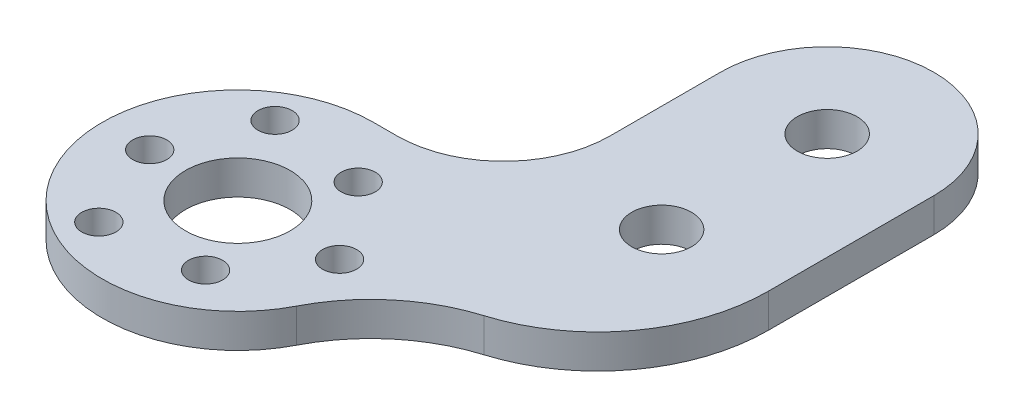
ISO-10303-21;
HEADER;
FILE_DESCRIPTION(('STEP AP214'),'2;1');
FILE_NAME('part.step','',(''),(''),'','','');
FILE_SCHEMA(('AUTOMOTIVE_DESIGN { 1 0 10303 214 1 1 1 1 }'));
ENDSEC;
DATA;
#1=APPLICATION_CONTEXT('core data for automotive mechanical design processes');
#2=APPLICATION_PROTOCOL_DEFINITION('international standard','automotive_design',2000,#1);
#3=PRODUCT_CONTEXT('',#1,'mechanical');
#4=PRODUCT('Part','Part','',(#3));
#5=PRODUCT_RELATED_PRODUCT_CATEGORY('part','',(#4));
#6=PRODUCT_DEFINITION_FORMATION('','',#4);
#7=PRODUCT_DEFINITION_CONTEXT('part definition',#1,'design');
#8=PRODUCT_DEFINITION('design','',#6,#7);
#9=PRODUCT_DEFINITION_SHAPE('','',#8);
#10=(LENGTH_UNIT() NAMED_UNIT(*) SI_UNIT(.MILLI.,.METRE.));
#11=(NAMED_UNIT(*) PLANE_ANGLE_UNIT() SI_UNIT($,.RADIAN.));
#12=(NAMED_UNIT(*) SI_UNIT($,.STERADIAN.) SOLID_ANGLE_UNIT());
#13=UNCERTAINTY_MEASURE_WITH_UNIT(LENGTH_MEASURE(1.E-05),#10,'distance_accuracy_value','');
#14=(GEOMETRIC_REPRESENTATION_CONTEXT(3) GLOBAL_UNCERTAINTY_ASSIGNED_CONTEXT((#13)) GLOBAL_UNIT_ASSIGNED_CONTEXT((#10,
#11,#12)) REPRESENTATION_CONTEXT('',''));
#15=CARTESIAN_POINT('',(0.,0.,0.));
#16=DIRECTION('',(0.,0.,1.));
#17=DIRECTION('',(1.,0.,0.));
#18=AXIS2_PLACEMENT_3D('',#15,#16,#17);
#19=CARTESIAN_POINT('',(22.18,3.175,-33.));
#20=DIRECTION('',(0.,1.,0.));
#21=DIRECTION('',(0.,0.,1.));
#22=AXIS2_PLACEMENT_3D('',#19,#20,#21);
#23=PLANE('',#22);
#24=CARTESIAN_POINT('',(-4.76313972081442,3.175,-8.25));
#25=DIRECTION('',(0.,1.,0.));
#26=DIRECTION('',(0.,0.,1.));
#27=AXIS2_PLACEMENT_3D('',#24,#25,#26);
#28=CIRCLE('',#27,1.6);
#29=CARTESIAN_POINT('',(-4.76313972081442,3.175,-6.65));
#30=VERTEX_POINT('',#29);
#31=EDGE_CURVE('E237',#30,#30,#28,.T.);
#32=ORIENTED_EDGE('',*,*,#31,.F.);
#33=EDGE_LOOP('',(#32));
#34=FACE_BOUND('',#33,.T.);
#35=CARTESIAN_POINT('',(-4.76313972081442,3.175,8.25));
#36=DIRECTION('',(0.,1.,0.));
#37=DIRECTION('',(0.,0.,1.));
#38=AXIS2_PLACEMENT_3D('',#35,#36,#37);
#39=CIRCLE('',#38,1.6);
#40=CARTESIAN_POINT('',(-4.76313972081442,3.175,9.85));
#41=VERTEX_POINT('',#40);
#42=EDGE_CURVE('E230',#41,#41,#39,.T.);
#43=ORIENTED_EDGE('',*,*,#42,.F.);
#44=EDGE_LOOP('',(#43));
#45=FACE_BOUND('',#44,.T.);
#46=CARTESIAN_POINT('',(9.52627944162883,3.175,0.));
#47=DIRECTION('',(0.,1.,0.));
#48=DIRECTION('',(0.,0.,1.));
#49=AXIS2_PLACEMENT_3D('',#46,#47,#48);
#50=CIRCLE('',#49,1.6);
#51=CARTESIAN_POINT('',(9.52627944162883,3.175,1.6));
#52=VERTEX_POINT('',#51);
#53=EDGE_CURVE('E223',#52,#52,#50,.T.);
#54=ORIENTED_EDGE('',*,*,#53,.F.);
#55=EDGE_LOOP('',(#54));
#56=FACE_BOUND('',#55,.T.);
#57=CARTESIAN_POINT('',(22.18,3.175,-33.));
#58=DIRECTION('',(0.,1.,0.));
#59=DIRECTION('',(0.,0.,1.));
#60=AXIS2_PLACEMENT_3D('',#57,#58,#59);
#61=CIRCLE('',#60,2.8);
#62=CARTESIAN_POINT('',(22.18,3.175,-30.2));
#63=VERTEX_POINT('',#62);
#64=EDGE_CURVE('E205',#63,#63,#61,.T.);
#65=ORIENTED_EDGE('',*,*,#64,.F.);
#66=EDGE_LOOP('',(#65));
#67=FACE_BOUND('',#66,.T.);
#68=CARTESIAN_POINT('',(4.125,3.175,7.14470958122162));
#69=DIRECTION('',(0.,1.,0.));
#70=DIRECTION('',(0.,0.,1.));
#71=AXIS2_PLACEMENT_3D('',#68,#69,#70);
#72=CIRCLE('',#71,1.6);
#73=CARTESIAN_POINT('',(4.125,3.175,8.74470958122162));
#74=VERTEX_POINT('',#73);
#75=EDGE_CURVE('E192',#74,#74,#72,.T.);
#76=ORIENTED_EDGE('',*,*,#75,.F.);
#77=EDGE_LOOP('',(#76));
#78=FACE_BOUND('',#77,.T.);
#79=CARTESIAN_POINT('',(-8.25,3.175,0.));
#80=DIRECTION('',(0.,1.,0.));
#81=DIRECTION('',(0.,0.,1.));
#82=AXIS2_PLACEMENT_3D('',#79,#80,#81);
#83=CIRCLE('',#82,1.6);
#84=CARTESIAN_POINT('',(-8.25,3.175,1.6));
#85=VERTEX_POINT('',#84);
#86=EDGE_CURVE('E136',#85,#85,#83,.T.);
#87=ORIENTED_EDGE('',*,*,#86,.F.);
#88=EDGE_LOOP('',(#87));
#89=FACE_BOUND('',#88,.T.);
#90=CARTESIAN_POINT('',(22.18,3.175,-33.));
#91=DIRECTION('',(0.,1.,0.));
#92=DIRECTION('',(0.,0.,1.));
#93=AXIS2_PLACEMENT_3D('',#90,#91,#92);
#94=CIRCLE('',#93,10.);
#95=CARTESIAN_POINT('',(32.18,3.175,-33.));
#96=VERTEX_POINT('',#95);
#97=CARTESIAN_POINT('',(12.18,3.175,-33.));
#98=VERTEX_POINT('',#97);
#99=EDGE_CURVE('E148',#96,#98,#94,.T.);
#100=ORIENTED_EDGE('',*,*,#99,.T.);
#101=DIRECTION('',(0.,0.,1.));
#102=VECTOR('',#101,1.);
#103=CARTESIAN_POINT('',(12.18,3.175,-33.));
#104=LINE('',#103,#102);
#105=CARTESIAN_POINT('',(12.18,3.175,-22.7));
#106=VERTEX_POINT('',#105);
#107=EDGE_CURVE('E94',#98,#106,#104,.T.);
#108=ORIENTED_EDGE('',*,*,#107,.T.);
#109=CARTESIAN_POINT('',(2.18,3.175,-22.7));
#110=DIRECTION('',(0.,-1.,0.));
#111=DIRECTION('',(0.,0.,1.));
#112=AXIS2_PLACEMENT_3D('',#109,#110,#111);
#113=CIRCLE('',#112,10.);
#114=CARTESIAN_POINT('',(2.18,3.175,-12.7));
#115=VERTEX_POINT('',#114);
#116=EDGE_CURVE('E164',#106,#115,#113,.T.);
#117=ORIENTED_EDGE('',*,*,#116,.T.);
#118=DIRECTION('',(-1.,0.,0.));
#119=VECTOR('',#118,1.);
#120=CARTESIAN_POINT('',(2.18,3.175,-12.7));
#121=LINE('',#120,#119);
#122=CARTESIAN_POINT('',(0.,3.175,-12.7));
#123=VERTEX_POINT('',#122);
#124=EDGE_CURVE('E177',#115,#123,#121,.T.);
#125=ORIENTED_EDGE('',*,*,#124,.T.);
#126=CARTESIAN_POINT('',(0.,3.175,0.));
#127=DIRECTION('',(0.,1.,0.));
#128=DIRECTION('',(0.,0.,1.));
#129=AXIS2_PLACEMENT_3D('',#126,#127,#128);
#130=CIRCLE('',#129,12.7);
#131=CARTESIAN_POINT('',(11.2993643402286,3.175,5.79778970873987));
#132=VERTEX_POINT('',#131);
#133=EDGE_CURVE('E113',#123,#132,#130,.T.);
#134=ORIENTED_EDGE('',*,*,#133,.T.);
#135=CARTESIAN_POINT('',(25.5347839814615,3.175,13.1020917040027));
#136=DIRECTION('',(0.,-1.,0.));
#137=DIRECTION('',(0.,0.,1.));
#138=AXIS2_PLACEMENT_3D('',#135,#136,#137);
#139=CIRCLE('',#138,16.);
#140=CARTESIAN_POINT('',(20.8573919907308,3.175,-2.19895414799865));
#141=VERTEX_POINT('',#140);
#142=EDGE_CURVE('E107',#132,#141,#139,.T.);
#143=ORIENTED_EDGE('',*,*,#142,.T.);
#144=CARTESIAN_POINT('',(16.18,3.175,-17.5));
#145=DIRECTION('',(0.,1.,0.));
#146=DIRECTION('',(0.,0.,-1.));
#147=AXIS2_PLACEMENT_3D('',#144,#145,#146);
#148=CIRCLE('',#147,16.);
#149=CARTESIAN_POINT('',(32.18,3.175,-17.5));
#150=VERTEX_POINT('',#149);
#151=EDGE_CURVE('E111',#141,#150,#148,.T.);
#152=ORIENTED_EDGE('',*,*,#151,.T.);
#153=DIRECTION('',(0.,0.,-1.));
#154=VECTOR('',#153,1.);
#155=CARTESIAN_POINT('',(32.18,3.175,-33.));
#156=LINE('',#155,#154);
#157=EDGE_CURVE('E51',#150,#96,#156,.T.);
#158=ORIENTED_EDGE('',*,*,#157,.T.);
#159=EDGE_LOOP('',(#100,#108,#117,#125,#134,#143,#152,#158));
#160=FACE_BOUND('',#159,.T.);
#161=CARTESIAN_POINT('',(4.125,3.175,-7.14470958122162));
#162=DIRECTION('',(0.,1.,0.));
#163=DIRECTION('',(0.,0.,1.));
#164=AXIS2_PLACEMENT_3D('',#161,#162,#163);
#165=CIRCLE('',#164,1.6);
#166=CARTESIAN_POINT('',(4.125,3.175,-5.54470958122162));
#167=VERTEX_POINT('',#166);
#168=EDGE_CURVE('E186',#167,#167,#165,.T.);
#169=ORIENTED_EDGE('',*,*,#168,.F.);
#170=EDGE_LOOP('',(#169));
#171=FACE_BOUND('',#170,.T.);
#172=CARTESIAN_POINT('',(22.18,3.175,-17.5));
#173=DIRECTION('',(0.,1.,0.));
#174=DIRECTION('',(0.,0.,1.));
#175=AXIS2_PLACEMENT_3D('',#172,#173,#174);
#176=CIRCLE('',#175,2.8);
#177=CARTESIAN_POINT('',(22.18,3.175,-14.7));
#178=VERTEX_POINT('',#177);
#179=EDGE_CURVE('E198',#178,#178,#176,.T.);
#180=ORIENTED_EDGE('',*,*,#179,.F.);
#181=EDGE_LOOP('',(#180));
#182=FACE_BOUND('',#181,.T.);
#183=CARTESIAN_POINT('',(0.,3.175,0.));
#184=DIRECTION('',(0.,1.,0.));
#185=DIRECTION('',(0.,0.,1.));
#186=AXIS2_PLACEMENT_3D('',#183,#184,#185);
#187=CIRCLE('',#186,4.9);
#188=CARTESIAN_POINT('',(0.,3.175,4.9));
#189=VERTEX_POINT('',#188);
#190=EDGE_CURVE('E211',#189,#189,#187,.T.);
#191=ORIENTED_EDGE('',*,*,#190,.F.);
#192=EDGE_LOOP('',(#191));
#193=FACE_BOUND('',#192,.T.);
#194=ADVANCED_FACE('F34',(#34,#45,#56,#67,#78,#89,#160,#171,#182,#193),#23,.T.);
#195=CARTESIAN_POINT('',(22.18,0.,-33.));
#196=DIRECTION('',(0.,1.,0.));
#197=DIRECTION('',(0.,0.,1.));
#198=AXIS2_PLACEMENT_3D('',#195,#196,#197);
#199=PLANE('',#198);
#200=CARTESIAN_POINT('',(-4.76313972081442,0.,-8.25));
#201=DIRECTION('',(0.,1.,0.));
#202=DIRECTION('',(0.,0.,1.));
#203=AXIS2_PLACEMENT_3D('',#200,#201,#202);
#204=CIRCLE('',#203,1.6);
#205=CARTESIAN_POINT('',(-4.76313972081442,0.,-6.65));
#206=VERTEX_POINT('',#205);
#207=EDGE_CURVE('E234',#206,#206,#204,.F.);
#208=ORIENTED_EDGE('',*,*,#207,.F.);
#209=EDGE_LOOP('',(#208));
#210=FACE_BOUND('',#209,.T.);
#211=CARTESIAN_POINT('',(-4.76313972081442,0.,8.25));
#212=DIRECTION('',(0.,1.,0.));
#213=DIRECTION('',(0.,0.,1.));
#214=AXIS2_PLACEMENT_3D('',#211,#212,#213);
#215=CIRCLE('',#214,1.6);
#216=CARTESIAN_POINT('',(-4.76313972081442,0.,9.85));
#217=VERTEX_POINT('',#216);
#218=EDGE_CURVE('E226',#217,#217,#215,.F.);
#219=ORIENTED_EDGE('',*,*,#218,.F.);
#220=EDGE_LOOP('',(#219));
#221=FACE_BOUND('',#220,.T.);
#222=CARTESIAN_POINT('',(9.52627944162883,0.,0.));
#223=DIRECTION('',(0.,1.,0.));
#224=DIRECTION('',(0.,0.,1.));
#225=AXIS2_PLACEMENT_3D('',#222,#223,#224);
#226=CIRCLE('',#225,1.6);
#227=CARTESIAN_POINT('',(9.52627944162883,0.,1.6));
#228=VERTEX_POINT('',#227);
#229=EDGE_CURVE('E217',#228,#228,#226,.F.);
#230=ORIENTED_EDGE('',*,*,#229,.F.);
#231=EDGE_LOOP('',(#230));
#232=FACE_BOUND('',#231,.T.);
#233=CARTESIAN_POINT('',(22.18,0.,-33.));
#234=DIRECTION('',(0.,1.,0.));
#235=DIRECTION('',(0.,0.,1.));
#236=AXIS2_PLACEMENT_3D('',#233,#234,#235);
#237=CIRCLE('',#236,2.8);
#238=CARTESIAN_POINT('',(22.18,0.,-30.2));
#239=VERTEX_POINT('',#238);
#240=EDGE_CURVE('E208',#239,#239,#237,.T.);
#241=ORIENTED_EDGE('',*,*,#240,.T.);
#242=EDGE_LOOP('',(#241));
#243=FACE_BOUND('',#242,.T.);
#244=CARTESIAN_POINT('',(4.125,0.,7.14470958122162));
#245=DIRECTION('',(0.,1.,0.));
#246=DIRECTION('',(0.,0.,1.));
#247=AXIS2_PLACEMENT_3D('',#244,#245,#246);
#248=CIRCLE('',#247,1.6);
#249=CARTESIAN_POINT('',(4.125,0.,8.74470958122162));
#250=VERTEX_POINT('',#249);
#251=EDGE_CURVE('E195',#250,#250,#248,.T.);
#252=ORIENTED_EDGE('',*,*,#251,.T.);
#253=EDGE_LOOP('',(#252));
#254=FACE_BOUND('',#253,.T.);
#255=CARTESIAN_POINT('',(-8.25,0.,0.));
#256=DIRECTION('',(0.,1.,0.));
#257=DIRECTION('',(0.,0.,1.));
#258=AXIS2_PLACEMENT_3D('',#255,#256,#257);
#259=CIRCLE('',#258,1.6);
#260=CARTESIAN_POINT('',(-8.25,0.,1.6));
#261=VERTEX_POINT('',#260);
#262=EDGE_CURVE('E183',#261,#261,#259,.T.);
#263=ORIENTED_EDGE('',*,*,#262,.T.);
#264=EDGE_LOOP('',(#263));
#265=FACE_BOUND('',#264,.T.);
#266=CARTESIAN_POINT('',(22.18,0.,-33.));
#267=DIRECTION('',(0.,1.,0.));
#268=DIRECTION('',(0.,0.,1.));
#269=AXIS2_PLACEMENT_3D('',#266,#267,#268);
#270=CIRCLE('',#269,10.);
#271=CARTESIAN_POINT('',(32.18,0.,-33.));
#272=VERTEX_POINT('',#271);
#273=CARTESIAN_POINT('',(12.18,0.,-33.));
#274=VERTEX_POINT('',#273);
#275=EDGE_CURVE('E132',#272,#274,#270,.T.);
#276=ORIENTED_EDGE('',*,*,#275,.F.);
#277=DIRECTION('',(0.,0.,-1.));
#278=VECTOR('',#277,1.);
#279=CARTESIAN_POINT('',(32.18,0.,-33.));
#280=LINE('',#279,#278);
#281=CARTESIAN_POINT('',(32.18,0.,-17.5));
#282=VERTEX_POINT('',#281);
#283=EDGE_CURVE('E86',#282,#272,#280,.T.);
#284=ORIENTED_EDGE('',*,*,#283,.F.);
#285=CARTESIAN_POINT('',(16.18,0.,-17.5));
#286=DIRECTION('',(0.,1.,0.));
#287=DIRECTION('',(0.,0.,-1.));
#288=AXIS2_PLACEMENT_3D('',#285,#286,#287);
#289=CIRCLE('',#288,16.);
#290=CARTESIAN_POINT('',(20.8573919907308,0.,-2.19895414799865));
#291=VERTEX_POINT('',#290);
#292=EDGE_CURVE('E80',#291,#282,#289,.T.);
#293=ORIENTED_EDGE('',*,*,#292,.F.);
#294=CARTESIAN_POINT('',(25.5347839814615,0.,13.1020917040027));
#295=DIRECTION('',(0.,-1.,0.));
#296=DIRECTION('',(0.,0.,1.));
#297=AXIS2_PLACEMENT_3D('',#294,#295,#296);
#298=CIRCLE('',#297,16.);
#299=CARTESIAN_POINT('',(11.2993643402286,0.,5.79778970873987));
#300=VERTEX_POINT('',#299);
#301=EDGE_CURVE('E121',#300,#291,#298,.T.);
#302=ORIENTED_EDGE('',*,*,#301,.F.);
#303=CARTESIAN_POINT('',(0.,0.,0.));
#304=DIRECTION('',(0.,1.,0.));
#305=DIRECTION('',(0.,0.,1.));
#306=AXIS2_PLACEMENT_3D('',#303,#304,#305);
#307=CIRCLE('',#306,12.7);
#308=CARTESIAN_POINT('',(0.,0.,-12.7));
#309=VERTEX_POINT('',#308);
#310=EDGE_CURVE('E143',#309,#300,#307,.T.);
#311=ORIENTED_EDGE('',*,*,#310,.F.);
#312=DIRECTION('',(-1.,0.,0.));
#313=VECTOR('',#312,1.);
#314=CARTESIAN_POINT('',(2.18,0.,-12.7));
#315=LINE('',#314,#313);
#316=CARTESIAN_POINT('',(2.18,0.,-12.7));
#317=VERTEX_POINT('',#316);
#318=EDGE_CURVE('E141',#317,#309,#315,.T.);
#319=ORIENTED_EDGE('',*,*,#318,.F.);
#320=CARTESIAN_POINT('',(2.18,0.,-22.7));
#321=DIRECTION('',(0.,-1.,0.));
#322=DIRECTION('',(0.,0.,1.));
#323=AXIS2_PLACEMENT_3D('',#320,#321,#322);
#324=CIRCLE('',#323,10.);
#325=CARTESIAN_POINT('',(12.18,0.,-22.7));
#326=VERTEX_POINT('',#325);
#327=EDGE_CURVE('E138',#326,#317,#324,.T.);
#328=ORIENTED_EDGE('',*,*,#327,.F.);
#329=DIRECTION('',(0.,0.,1.));
#330=VECTOR('',#329,1.);
#331=CARTESIAN_POINT('',(12.18,0.,-33.));
#332=LINE('',#331,#330);
#333=EDGE_CURVE('E135',#274,#326,#332,.T.);
#334=ORIENTED_EDGE('',*,*,#333,.F.);
#335=EDGE_LOOP('',(#276,#284,#293,#302,#311,#319,#328,#334));
#336=FACE_BOUND('',#335,.T.);
#337=CARTESIAN_POINT('',(4.125,0.,-7.14470958122162));
#338=DIRECTION('',(0.,1.,0.));
#339=DIRECTION('',(0.,0.,1.));
#340=AXIS2_PLACEMENT_3D('',#337,#338,#339);
#341=CIRCLE('',#340,1.6);
#342=CARTESIAN_POINT('',(4.125,0.,-5.54470958122162));
#343=VERTEX_POINT('',#342);
#344=EDGE_CURVE('E189',#343,#343,#341,.T.);
#345=ORIENTED_EDGE('',*,*,#344,.T.);
#346=EDGE_LOOP('',(#345));
#347=FACE_BOUND('',#346,.T.);
#348=CARTESIAN_POINT('',(22.18,0.,-17.5));
#349=DIRECTION('',(0.,1.,0.));
#350=DIRECTION('',(0.,0.,1.));
#351=AXIS2_PLACEMENT_3D('',#348,#349,#350);
#352=CIRCLE('',#351,2.8);
#353=CARTESIAN_POINT('',(22.18,0.,-14.7));
#354=VERTEX_POINT('',#353);
#355=EDGE_CURVE('E202',#354,#354,#352,.T.);
#356=ORIENTED_EDGE('',*,*,#355,.T.);
#357=EDGE_LOOP('',(#356));
#358=FACE_BOUND('',#357,.T.);
#359=CARTESIAN_POINT('',(0.,0.,0.));
#360=DIRECTION('',(0.,1.,0.));
#361=DIRECTION('',(0.,0.,1.));
#362=AXIS2_PLACEMENT_3D('',#359,#360,#361);
#363=CIRCLE('',#362,4.9);
#364=CARTESIAN_POINT('',(0.,0.,4.9));
#365=VERTEX_POINT('',#364);
#366=EDGE_CURVE('E214',#365,#365,#363,.T.);
#367=ORIENTED_EDGE('',*,*,#366,.T.);
#368=EDGE_LOOP('',(#367));
#369=FACE_BOUND('',#368,.T.);
#370=ADVANCED_FACE('F168',(#210,#221,#232,#243,#254,#265,#336,#347,#358,#369),#199,.F.);
#371=CARTESIAN_POINT('',(22.18,3.175,-33.));
#372=DIRECTION('',(0.,-1.,0.));
#373=DIRECTION('',(0.,0.,-1.));
#374=AXIS2_PLACEMENT_3D('',#371,#372,#373);
#375=CYLINDRICAL_SURFACE('',#374,10.);
#376=ORIENTED_EDGE('',*,*,#275,.T.);
#377=DIRECTION('',(0.,-1.,0.));
#378=VECTOR('',#377,1.);
#379=CARTESIAN_POINT('',(12.18,3.175,-33.));
#380=LINE('',#379,#378);
#381=EDGE_CURVE('E11',#98,#274,#380,.T.);
#382=ORIENTED_EDGE('',*,*,#381,.F.);
#383=ORIENTED_EDGE('',*,*,#99,.F.);
#384=DIRECTION('',(0.,-1.,0.));
#385=VECTOR('',#384,1.);
#386=CARTESIAN_POINT('',(32.18,3.175,-33.));
#387=LINE('',#386,#385);
#388=EDGE_CURVE('E128',#96,#272,#387,.T.);
#389=ORIENTED_EDGE('',*,*,#388,.T.);
#390=EDGE_LOOP('',(#376,#382,#383,#389));
#391=FACE_BOUND('',#390,.T.);
#392=ADVANCED_FACE('F36',(#391),#375,.T.);
#393=CARTESIAN_POINT('',(12.18,3.175,-33.));
#394=DIRECTION('',(1.,0.,0.));
#395=DIRECTION('',(0.,0.,-1.));
#396=AXIS2_PLACEMENT_3D('',#393,#394,#395);
#397=PLANE('',#396);
#398=ORIENTED_EDGE('',*,*,#333,.T.);
#399=DIRECTION('',(0.,-1.,0.));
#400=VECTOR('',#399,1.);
#401=CARTESIAN_POINT('',(12.18,3.175,-22.7));
#402=LINE('',#401,#400);
#403=EDGE_CURVE('E43',#106,#326,#402,.T.);
#404=ORIENTED_EDGE('',*,*,#403,.F.);
#405=ORIENTED_EDGE('',*,*,#107,.F.);
#406=ORIENTED_EDGE('',*,*,#381,.T.);
#407=EDGE_LOOP('',(#398,#404,#405,#406));
#408=FACE_BOUND('',#407,.T.);
#409=ADVANCED_FACE('F273',(#408),#397,.F.);
#410=CARTESIAN_POINT('',(2.18,3.175,-22.7));
#411=DIRECTION('',(0.,-1.,0.));
#412=DIRECTION('',(0.,0.,-1.));
#413=AXIS2_PLACEMENT_3D('',#410,#411,#412);
#414=CYLINDRICAL_SURFACE('',#413,10.);
#415=ORIENTED_EDGE('',*,*,#327,.T.);
#416=DIRECTION('',(0.,-1.,0.));
#417=VECTOR('',#416,1.);
#418=CARTESIAN_POINT('',(2.18,3.175,-12.7));
#419=LINE('',#418,#417);
#420=EDGE_CURVE('E155',#115,#317,#419,.T.);
#421=ORIENTED_EDGE('',*,*,#420,.F.);
#422=ORIENTED_EDGE('',*,*,#116,.F.);
#423=ORIENTED_EDGE('',*,*,#403,.T.);
#424=EDGE_LOOP('',(#415,#421,#422,#423));
#425=FACE_BOUND('',#424,.T.);
#426=ADVANCED_FACE('F162',(#425),#414,.F.);
#427=CARTESIAN_POINT('',(2.18,3.175,-12.7));
#428=DIRECTION('',(0.,0.,1.));
#429=DIRECTION('',(1.,0.,0.));
#430=AXIS2_PLACEMENT_3D('',#427,#428,#429);
#431=PLANE('',#430);
#432=ORIENTED_EDGE('',*,*,#318,.T.);
#433=DIRECTION('',(0.,-1.,0.));
#434=VECTOR('',#433,1.);
#435=CARTESIAN_POINT('',(0.,3.175,-12.7));
#436=LINE('',#435,#434);
#437=EDGE_CURVE('E152',#123,#309,#436,.T.);
#438=ORIENTED_EDGE('',*,*,#437,.F.);
#439=ORIENTED_EDGE('',*,*,#124,.F.);
#440=ORIENTED_EDGE('',*,*,#420,.T.);
#441=EDGE_LOOP('',(#432,#438,#439,#440));
#442=FACE_BOUND('',#441,.T.);
#443=ADVANCED_FACE('F173',(#442),#431,.F.);
#444=CARTESIAN_POINT('',(0.,3.175,0.));
#445=DIRECTION('',(0.,-1.,0.));
#446=DIRECTION('',(0.,0.,-1.));
#447=AXIS2_PLACEMENT_3D('',#444,#445,#446);
#448=CYLINDRICAL_SURFACE('',#447,12.7);
#449=ORIENTED_EDGE('',*,*,#310,.T.);
#450=DIRECTION('',(0.,-1.,0.));
#451=VECTOR('',#450,1.);
#452=CARTESIAN_POINT('',(11.2993643402286,3.175,5.79778970873987));
#453=LINE('',#452,#451);
#454=EDGE_CURVE('E123',#132,#300,#453,.T.);
#455=ORIENTED_EDGE('',*,*,#454,.F.);
#456=ORIENTED_EDGE('',*,*,#133,.F.);
#457=ORIENTED_EDGE('',*,*,#437,.T.);
#458=EDGE_LOOP('',(#449,#455,#456,#457));
#459=FACE_BOUND('',#458,.T.);
#460=ADVANCED_FACE('F176',(#459),#448,.T.);
#461=CARTESIAN_POINT('',(25.5347839814615,3.175,13.1020917040027));
#462=DIRECTION('',(0.,-1.,0.));
#463=DIRECTION('',(0.,0.,-1.));
#464=AXIS2_PLACEMENT_3D('',#461,#462,#463);
#465=CYLINDRICAL_SURFACE('',#464,16.);
#466=ORIENTED_EDGE('',*,*,#301,.T.);
#467=DIRECTION('',(0.,-1.,0.));
#468=VECTOR('',#467,1.);
#469=CARTESIAN_POINT('',(20.8573919907308,3.175,-2.19895414799865));
#470=LINE('',#469,#468);
#471=EDGE_CURVE('E118',#141,#291,#470,.T.);
#472=ORIENTED_EDGE('',*,*,#471,.F.);
#473=ORIENTED_EDGE('',*,*,#142,.F.);
#474=ORIENTED_EDGE('',*,*,#454,.T.);
#475=EDGE_LOOP('',(#466,#472,#473,#474));
#476=FACE_BOUND('',#475,.T.);
#477=ADVANCED_FACE('F119',(#476),#465,.F.);
#478=CARTESIAN_POINT('',(16.18,3.175,-17.5));
#479=DIRECTION('',(0.,-1.,0.));
#480=DIRECTION('',(0.,0.,-1.));
#481=AXIS2_PLACEMENT_3D('',#478,#479,#480);
#482=CYLINDRICAL_SURFACE('',#481,16.);
#483=ORIENTED_EDGE('',*,*,#292,.T.);
#484=DIRECTION('',(0.,-1.,0.));
#485=VECTOR('',#484,1.);
#486=CARTESIAN_POINT('',(32.18,3.175,-17.5));
#487=LINE('',#486,#485);
#488=EDGE_CURVE('E124',#150,#282,#487,.T.);
#489=ORIENTED_EDGE('',*,*,#488,.F.);
#490=ORIENTED_EDGE('',*,*,#151,.F.);
#491=ORIENTED_EDGE('',*,*,#471,.T.);
#492=EDGE_LOOP('',(#483,#489,#490,#491));
#493=FACE_BOUND('',#492,.T.);
#494=ADVANCED_FACE('F126',(#493),#482,.T.);
#495=CARTESIAN_POINT('',(32.18,3.175,-33.));
#496=DIRECTION('',(-1.,0.,0.));
#497=DIRECTION('',(0.,0.,1.));
#498=AXIS2_PLACEMENT_3D('',#495,#496,#497);
#499=PLANE('',#498);
#500=ORIENTED_EDGE('',*,*,#283,.T.);
#501=ORIENTED_EDGE('',*,*,#388,.F.);
#502=ORIENTED_EDGE('',*,*,#157,.F.);
#503=ORIENTED_EDGE('',*,*,#488,.T.);
#504=EDGE_LOOP('',(#500,#501,#502,#503));
#505=FACE_BOUND('',#504,.T.);
#506=ADVANCED_FACE('F263',(#505),#499,.F.);
#507=CARTESIAN_POINT('',(-8.25,3.175,0.));
#508=DIRECTION('',(0.,-1.,0.));
#509=DIRECTION('',(0.,0.,-1.));
#510=AXIS2_PLACEMENT_3D('',#507,#508,#509);
#511=CYLINDRICAL_SURFACE('',#510,1.6);
#512=ORIENTED_EDGE('',*,*,#86,.T.);
#513=EDGE_LOOP('',(#512));
#514=FACE_BOUND('',#513,.T.);
#515=ORIENTED_EDGE('',*,*,#262,.F.);
#516=EDGE_LOOP('',(#515));
#517=FACE_BOUND('',#516,.T.);
#518=ADVANCED_FACE('F259',(#514,#517),#511,.F.);
#519=CARTESIAN_POINT('',(4.125,3.175,-7.14470958122162));
#520=DIRECTION('',(0.,-1.,0.));
#521=DIRECTION('',(0.,0.,-1.));
#522=AXIS2_PLACEMENT_3D('',#519,#520,#521);
#523=CYLINDRICAL_SURFACE('',#522,1.6);
#524=ORIENTED_EDGE('',*,*,#168,.T.);
#525=EDGE_LOOP('',(#524));
#526=FACE_BOUND('',#525,.T.);
#527=ORIENTED_EDGE('',*,*,#344,.F.);
#528=EDGE_LOOP('',(#527));
#529=FACE_BOUND('',#528,.T.);
#530=ADVANCED_FACE('F262',(#526,#529),#523,.F.);
#531=CARTESIAN_POINT('',(4.125,3.175,7.14470958122162));
#532=DIRECTION('',(0.,-1.,0.));
#533=DIRECTION('',(0.,0.,-1.));
#534=AXIS2_PLACEMENT_3D('',#531,#532,#533);
#535=CYLINDRICAL_SURFACE('',#534,1.6);
#536=ORIENTED_EDGE('',*,*,#75,.T.);
#537=EDGE_LOOP('',(#536));
#538=FACE_BOUND('',#537,.T.);
#539=ORIENTED_EDGE('',*,*,#251,.F.);
#540=EDGE_LOOP('',(#539));
#541=FACE_BOUND('',#540,.T.);
#542=ADVANCED_FACE('F330',(#538,#541),#535,.F.);
#543=CARTESIAN_POINT('',(22.18,3.175,-17.5));
#544=DIRECTION('',(0.,-1.,0.));
#545=DIRECTION('',(0.,0.,-1.));
#546=AXIS2_PLACEMENT_3D('',#543,#544,#545);
#547=CYLINDRICAL_SURFACE('',#546,2.8);
#548=ORIENTED_EDGE('',*,*,#179,.T.);
#549=EDGE_LOOP('',(#548));
#550=FACE_BOUND('',#549,.T.);
#551=ORIENTED_EDGE('',*,*,#355,.F.);
#552=EDGE_LOOP('',(#551));
#553=FACE_BOUND('',#552,.T.);
#554=ADVANCED_FACE('F338',(#550,#553),#547,.F.);
#555=CARTESIAN_POINT('',(22.18,3.175,-33.));
#556=DIRECTION('',(0.,-1.,0.));
#557=DIRECTION('',(0.,0.,-1.));
#558=AXIS2_PLACEMENT_3D('',#555,#556,#557);
#559=CYLINDRICAL_SURFACE('',#558,2.8);
#560=ORIENTED_EDGE('',*,*,#64,.T.);
#561=EDGE_LOOP('',(#560));
#562=FACE_BOUND('',#561,.T.);
#563=ORIENTED_EDGE('',*,*,#240,.F.);
#564=EDGE_LOOP('',(#563));
#565=FACE_BOUND('',#564,.T.);
#566=ADVANCED_FACE('F346',(#562,#565),#559,.F.);
#567=CARTESIAN_POINT('',(0.,3.175,0.));
#568=DIRECTION('',(0.,-1.,0.));
#569=DIRECTION('',(0.,0.,-1.));
#570=AXIS2_PLACEMENT_3D('',#567,#568,#569);
#571=CYLINDRICAL_SURFACE('',#570,4.9);
#572=ORIENTED_EDGE('',*,*,#190,.T.);
#573=EDGE_LOOP('',(#572));
#574=FACE_BOUND('',#573,.T.);
#575=ORIENTED_EDGE('',*,*,#366,.F.);
#576=EDGE_LOOP('',(#575));
#577=FACE_BOUND('',#576,.T.);
#578=ADVANCED_FACE('F354',(#574,#577),#571,.F.);
#579=CARTESIAN_POINT('',(9.52627944162883,-0.00100000000000013,0.));
#580=DIRECTION('',(0.,1.,0.));
#581=DIRECTION('',(0.,0.,1.));
#582=AXIS2_PLACEMENT_3D('',#579,#580,#581);
#583=CYLINDRICAL_SURFACE('',#582,1.6);
#584=ORIENTED_EDGE('',*,*,#53,.T.);
#585=EDGE_LOOP('',(#584));
#586=FACE_BOUND('',#585,.T.);
#587=ORIENTED_EDGE('',*,*,#229,.T.);
#588=EDGE_LOOP('',(#587));
#589=FACE_BOUND('',#588,.T.);
#590=ADVANCED_FACE('F363',(#586,#589),#583,.F.);
#591=CARTESIAN_POINT('',(-4.76313972081442,-0.00100000000000013,8.25));
#592=DIRECTION('',(0.,1.,0.));
#593=DIRECTION('',(0.,0.,1.));
#594=AXIS2_PLACEMENT_3D('',#591,#592,#593);
#595=CYLINDRICAL_SURFACE('',#594,1.6);
#596=ORIENTED_EDGE('',*,*,#42,.T.);
#597=EDGE_LOOP('',(#596));
#598=FACE_BOUND('',#597,.T.);
#599=ORIENTED_EDGE('',*,*,#218,.T.);
#600=EDGE_LOOP('',(#599));
#601=FACE_BOUND('',#600,.T.);
#602=ADVANCED_FACE('F370',(#598,#601),#595,.F.);
#603=CARTESIAN_POINT('',(-4.76313972081442,-0.00100000000000013,-8.25));
#604=DIRECTION('',(0.,1.,0.));
#605=DIRECTION('',(0.,0.,1.));
#606=AXIS2_PLACEMENT_3D('',#603,#604,#605);
#607=CYLINDRICAL_SURFACE('',#606,1.6);
#608=ORIENTED_EDGE('',*,*,#31,.T.);
#609=EDGE_LOOP('',(#608));
#610=FACE_BOUND('',#609,.T.);
#611=ORIENTED_EDGE('',*,*,#207,.T.);
#612=EDGE_LOOP('',(#611));
#613=FACE_BOUND('',#612,.T.);
#614=ADVANCED_FACE('F243',(#610,#613),#607,.F.);
#615=CLOSED_SHELL('',(#194,#370,#392,#409,#426,#443,#460,#477,#494,#506,#518,#530,#542,#554,
#566,#578,#590,#602,#614));
#616=MANIFOLD_SOLID_BREP('B2',#615);
#617=ADVANCED_BREP_SHAPE_REPRESENTATION('',(#18,#616),#14);
#618=SHAPE_DEFINITION_REPRESENTATION(#9,#617);
ENDSEC;
END-ISO-10303-21;
